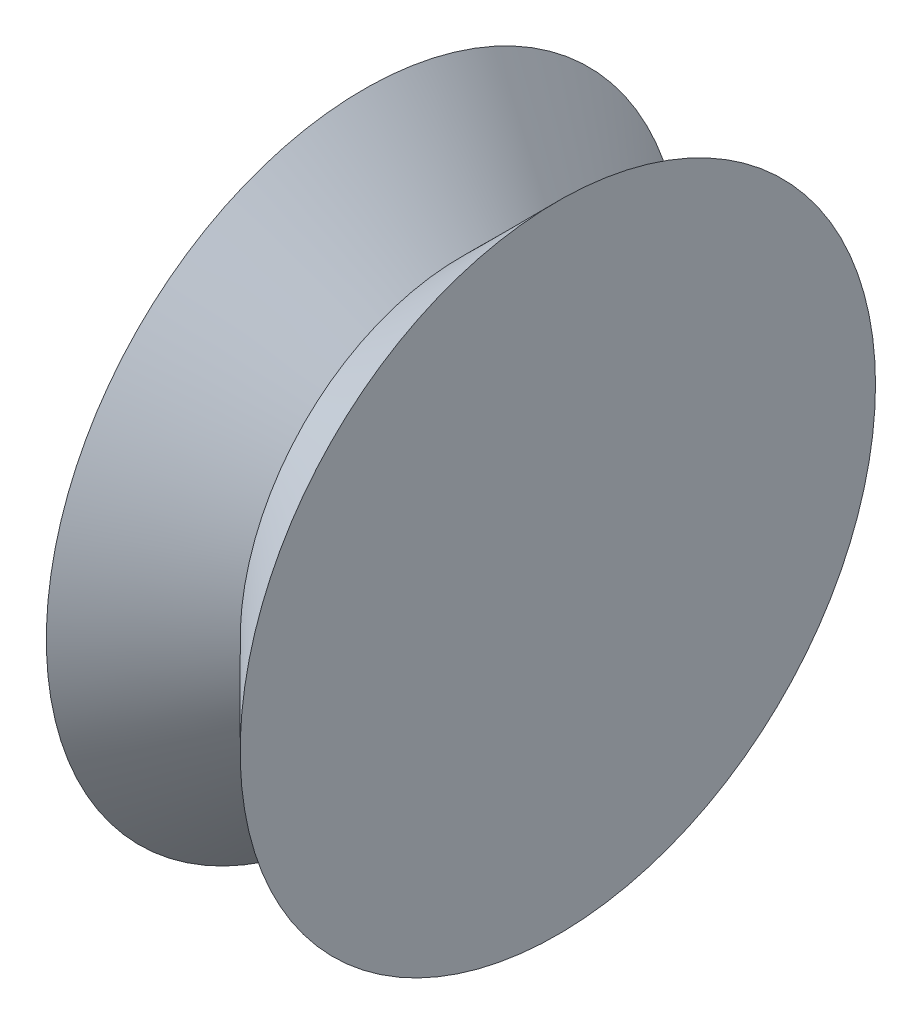
ISO-10303-21;
HEADER;
FILE_DESCRIPTION(('STEP AP214'),'2;1');
FILE_NAME('part.step','',(''),(''),'','','');
FILE_SCHEMA(('AUTOMOTIVE_DESIGN { 1 0 10303 214 1 1 1 1 }'));
ENDSEC;
DATA;
#1=APPLICATION_CONTEXT('core data for automotive mechanical design processes');
#2=APPLICATION_PROTOCOL_DEFINITION('international standard','automotive_design',2000,#1);
#3=PRODUCT_CONTEXT('',#1,'mechanical');
#4=PRODUCT('Part','Part','',(#3));
#5=PRODUCT_RELATED_PRODUCT_CATEGORY('part','',(#4));
#6=PRODUCT_DEFINITION_FORMATION('','',#4);
#7=PRODUCT_DEFINITION_CONTEXT('part definition',#1,'design');
#8=PRODUCT_DEFINITION('design','',#6,#7);
#9=PRODUCT_DEFINITION_SHAPE('','',#8);
#10=(LENGTH_UNIT() NAMED_UNIT(*) SI_UNIT(.MILLI.,.METRE.));
#11=(NAMED_UNIT(*) PLANE_ANGLE_UNIT() SI_UNIT($,.RADIAN.));
#12=(NAMED_UNIT(*) SI_UNIT($,.STERADIAN.) SOLID_ANGLE_UNIT());
#13=UNCERTAINTY_MEASURE_WITH_UNIT(LENGTH_MEASURE(1.E-05),#10,'distance_accuracy_value','');
#14=(GEOMETRIC_REPRESENTATION_CONTEXT(3) GLOBAL_UNCERTAINTY_ASSIGNED_CONTEXT((#13)) GLOBAL_UNIT_ASSIGNED_CONTEXT((#10,
#11,#12)) REPRESENTATION_CONTEXT('',''));
#15=CARTESIAN_POINT('',(0.,0.,0.));
#16=DIRECTION('',(0.,0.,1.));
#17=DIRECTION('',(1.,0.,0.));
#18=AXIS2_PLACEMENT_3D('',#15,#16,#17);
#19=CARTESIAN_POINT('',(-2.95275590551178,0.,3.51377952755906));
#20=DIRECTION('',(-1.,0.,0.));
#21=DIRECTION('',(0.,0.,1.));
#22=AXIS2_PLACEMENT_3D('',#19,#20,#21);
#23=CONICAL_SURFACE('',#22,6.25393700787405,0.785398163397435);
#24=CARTESIAN_POINT('',(-5.6988188976378,0.,3.51377952755906));
#25=DIRECTION('',(1.,0.,0.));
#26=DIRECTION('',(0.,0.,-1.));
#27=AXIS2_PLACEMENT_3D('',#24,#25,#26);
#28=CIRCLE('',#27,9.);
#29=CARTESIAN_POINT('',(-5.6988188976378,0.,-5.48622047244094));
#30=VERTEX_POINT('',#29);
#31=EDGE_CURVE('E10',#30,#30,#28,.T.);
#32=ORIENTED_EDGE('',*,*,#31,.T.);
#33=EDGE_LOOP('',(#32));
#34=FACE_BOUND('',#33,.T.);
#35=CARTESIAN_POINT('',(-2.95275590551178,0.,3.51377952755906));
#36=DIRECTION('',(1.,0.,0.));
#37=DIRECTION('',(0.,0.,-1.));
#38=AXIS2_PLACEMENT_3D('',#35,#36,#37);
#39=CIRCLE('',#38,6.25393700787405);
#40=CARTESIAN_POINT('',(-2.95275590551178,0.,-2.740157480315));
#41=VERTEX_POINT('',#40);
#42=EDGE_CURVE('E55',#41,#41,#39,.T.);
#43=ORIENTED_EDGE('',*,*,#42,.F.);
#44=EDGE_LOOP('',(#43));
#45=FACE_BOUND('',#44,.T.);
#46=ADVANCED_FACE('F43',(#34,#45),#23,.T.);
#47=CARTESIAN_POINT('',(-5.6988188976378,0.,-5.48622047244094));
#48=DIRECTION('',(-1.,0.,0.));
#49=DIRECTION('',(0.,0.,1.));
#50=AXIS2_PLACEMENT_3D('',#47,#48,#49);
#51=PLANE('',#50);
#52=ORIENTED_EDGE('',*,*,#31,.F.);
#53=EDGE_LOOP('',(#52));
#54=FACE_BOUND('',#53,.T.);
#55=ADVANCED_FACE('F67',(#54),#51,.T.);
#56=CARTESIAN_POINT('',(-0.206692913385896,0.,-5.48622047244095));
#57=DIRECTION('',(1.,0.,0.));
#58=DIRECTION('',(0.,0.,-1.));
#59=AXIS2_PLACEMENT_3D('',#56,#57,#58);
#60=PLANE('',#59);
#61=CARTESIAN_POINT('',(-0.206692913385897,0.,3.51377952755906));
#62=DIRECTION('',(1.,0.,0.));
#63=DIRECTION('',(0.,0.,-1.));
#64=AXIS2_PLACEMENT_3D('',#61,#62,#63);
#65=CIRCLE('',#64,9.00000000000001);
#66=CARTESIAN_POINT('',(-0.206692913385897,0.,-5.48622047244095));
#67=VERTEX_POINT('',#66);
#68=EDGE_CURVE('E50',#67,#67,#65,.T.);
#69=ORIENTED_EDGE('',*,*,#68,.T.);
#70=EDGE_LOOP('',(#69));
#71=FACE_BOUND('',#70,.T.);
#72=ADVANCED_FACE('F71',(#71),#60,.T.);
#73=CARTESIAN_POINT('',(-0.206692913385897,0.,3.51377952755906));
#74=DIRECTION('',(1.,0.,0.));
#75=DIRECTION('',(0.,0.,-1.));
#76=AXIS2_PLACEMENT_3D('',#73,#74,#75);
#77=CONICAL_SURFACE('',#76,9.00000000000001,0.785398163397462);
#78=ORIENTED_EDGE('',*,*,#42,.T.);
#79=EDGE_LOOP('',(#78));
#80=FACE_BOUND('',#79,.T.);
#81=ORIENTED_EDGE('',*,*,#68,.F.);
#82=EDGE_LOOP('',(#81));
#83=FACE_BOUND('',#82,.T.);
#84=ADVANCED_FACE('F63',(#80,#83),#77,.T.);
#85=CLOSED_SHELL('',(#46,#55,#72,#84));
#86=MANIFOLD_SOLID_BREP('B2',#85);
#87=ADVANCED_BREP_SHAPE_REPRESENTATION('',(#18,#86),#14);
#88=SHAPE_DEFINITION_REPRESENTATION(#9,#87);
ENDSEC;
END-ISO-10303-21;
